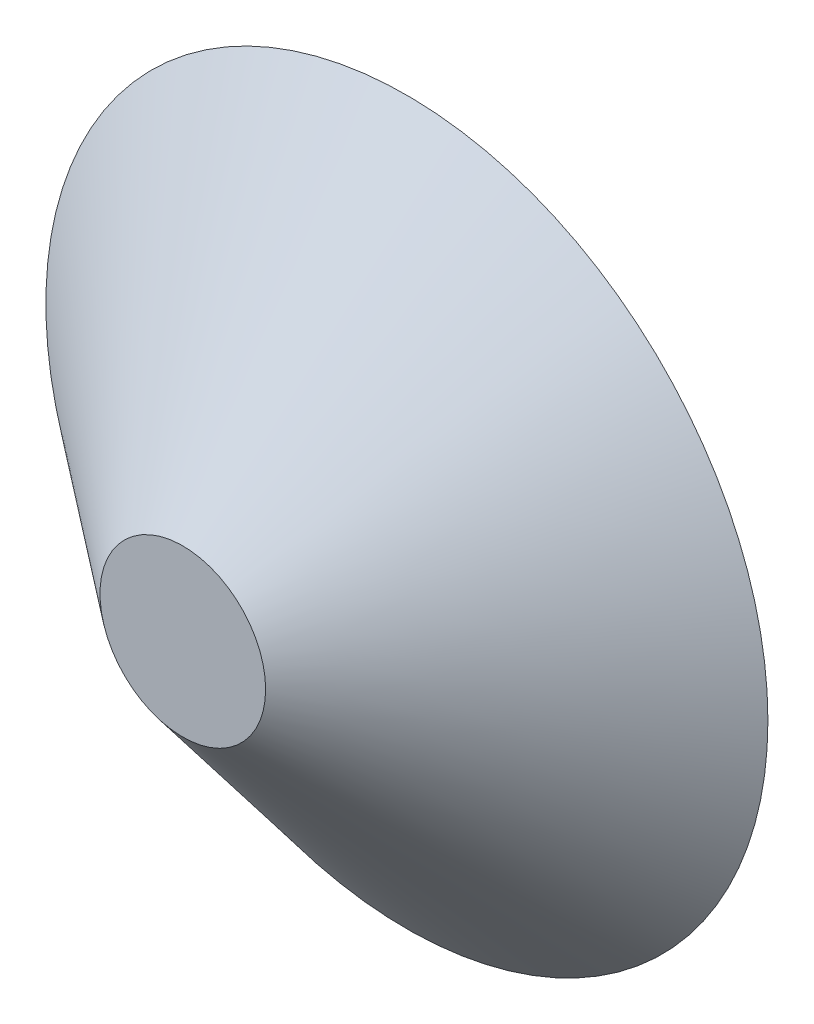
ISO-10303-21;
HEADER;
FILE_DESCRIPTION(('STEP AP214'),'2;1');
FILE_NAME('part.step','',(''),(''),'','','');
FILE_SCHEMA(('AUTOMOTIVE_DESIGN { 1 0 10303 214 1 1 1 1 }'));
ENDSEC;
DATA;
#1=APPLICATION_CONTEXT('core data for automotive mechanical design processes');
#2=APPLICATION_PROTOCOL_DEFINITION('international standard','automotive_design',2000,#1);
#3=PRODUCT_CONTEXT('',#1,'mechanical');
#4=PRODUCT('Part','Part','',(#3));
#5=PRODUCT_RELATED_PRODUCT_CATEGORY('part','',(#4));
#6=PRODUCT_DEFINITION_FORMATION('','',#4);
#7=PRODUCT_DEFINITION_CONTEXT('part definition',#1,'design');
#8=PRODUCT_DEFINITION('design','',#6,#7);
#9=PRODUCT_DEFINITION_SHAPE('','',#8);
#10=(LENGTH_UNIT() NAMED_UNIT(*) SI_UNIT(.MILLI.,.METRE.));
#11=(NAMED_UNIT(*) PLANE_ANGLE_UNIT() SI_UNIT($,.RADIAN.));
#12=(NAMED_UNIT(*) SI_UNIT($,.STERADIAN.) SOLID_ANGLE_UNIT());
#13=UNCERTAINTY_MEASURE_WITH_UNIT(LENGTH_MEASURE(1.E-05),#10,'distance_accuracy_value','');
#14=(GEOMETRIC_REPRESENTATION_CONTEXT(3) GLOBAL_UNCERTAINTY_ASSIGNED_CONTEXT((#13)) GLOBAL_UNIT_ASSIGNED_CONTEXT((#10,
#11,#12)) REPRESENTATION_CONTEXT('',''));
#15=CARTESIAN_POINT('',(0.,0.,0.));
#16=DIRECTION('',(0.,0.,1.));
#17=DIRECTION('',(1.,0.,0.));
#18=AXIS2_PLACEMENT_3D('',#15,#16,#17);
#19=CARTESIAN_POINT('',(0.,0.,0.));
#20=DIRECTION('',(0.,0.,-1.));
#21=DIRECTION('',(1.,0.,0.));
#22=AXIS2_PLACEMENT_3D('',#19,#20,#21);
#23=CONICAL_SURFACE('',#22,82.96975,0.892735912395102);
#24=CARTESIAN_POINT('',(0.,0.,51.5));
#25=DIRECTION('',(0.,0.,1.));
#26=DIRECTION('',(1.,0.,0.));
#27=AXIS2_PLACEMENT_3D('',#24,#25,#26);
#28=CIRCLE('',#27,19.0310080131996);
#29=CARTESIAN_POINT('',(19.0310080131996,0.,51.5));
#30=VERTEX_POINT('',#29);
#31=EDGE_CURVE('E10',#30,#30,#28,.T.);
#32=ORIENTED_EDGE('',*,*,#31,.F.);
#33=EDGE_LOOP('',(#32));
#34=FACE_BOUND('',#33,.T.);
#35=CARTESIAN_POINT('',(0.,0.,0.));
#36=DIRECTION('',(0.,0.,1.));
#37=DIRECTION('',(1.,0.,0.));
#38=AXIS2_PLACEMENT_3D('',#35,#36,#37);
#39=CIRCLE('',#38,82.96975);
#40=CARTESIAN_POINT('',(82.96975,0.,0.));
#41=VERTEX_POINT('',#40);
#42=EDGE_CURVE('E39',#41,#41,#39,.T.);
#43=ORIENTED_EDGE('',*,*,#42,.T.);
#44=EDGE_LOOP('',(#43));
#45=FACE_BOUND('',#44,.T.);
#46=ADVANCED_FACE('F33',(#34,#45),#23,.T.);
#47=CARTESIAN_POINT('',(0.,0.,51.5));
#48=DIRECTION('',(0.,0.,1.));
#49=DIRECTION('',(1.,0.,0.));
#50=AXIS2_PLACEMENT_3D('',#47,#48,#49);
#51=PLANE('',#50);
#52=ORIENTED_EDGE('',*,*,#31,.T.);
#53=EDGE_LOOP('',(#52));
#54=FACE_BOUND('',#53,.T.);
#55=ADVANCED_FACE('F48',(#54),#51,.T.);
#56=CARTESIAN_POINT('',(0.,0.,0.));
#57=DIRECTION('',(0.,0.,1.));
#58=DIRECTION('',(1.,0.,0.));
#59=AXIS2_PLACEMENT_3D('',#56,#57,#58);
#60=PLANE('',#59);
#61=ORIENTED_EDGE('',*,*,#42,.F.);
#62=EDGE_LOOP('',(#61));
#63=FACE_BOUND('',#62,.T.);
#64=ADVANCED_FACE('F46',(#63),#60,.F.);
#65=CLOSED_SHELL('',(#46,#55,#64));
#66=MANIFOLD_SOLID_BREP('B2',#65);
#67=ADVANCED_BREP_SHAPE_REPRESENTATION('',(#18,#66),#14);
#68=SHAPE_DEFINITION_REPRESENTATION(#9,#67);
ENDSEC;
END-ISO-10303-21;
